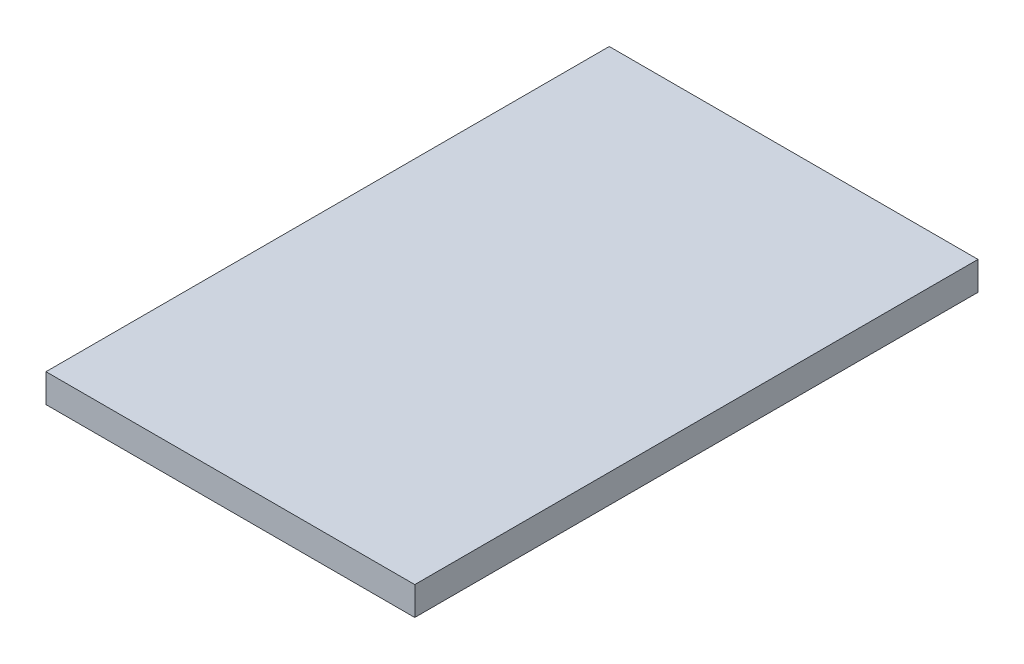
ISO-10303-21;
HEADER;
FILE_DESCRIPTION(('STEP AP214'),'2;1');
FILE_NAME('part.step','',(''),(''),'','','');
FILE_SCHEMA(('AUTOMOTIVE_DESIGN { 1 0 10303 214 1 1 1 1 }'));
ENDSEC;
DATA;
#1=APPLICATION_CONTEXT('core data for automotive mechanical design processes');
#2=APPLICATION_PROTOCOL_DEFINITION('international standard','automotive_design',2000,#1);
#3=PRODUCT_CONTEXT('',#1,'mechanical');
#4=PRODUCT('Part','Part','',(#3));
#5=PRODUCT_RELATED_PRODUCT_CATEGORY('part','',(#4));
#6=PRODUCT_DEFINITION_FORMATION('','',#4);
#7=PRODUCT_DEFINITION_CONTEXT('part definition',#1,'design');
#8=PRODUCT_DEFINITION('design','',#6,#7);
#9=PRODUCT_DEFINITION_SHAPE('','',#8);
#10=(LENGTH_UNIT() NAMED_UNIT(*) SI_UNIT(.MILLI.,.METRE.));
#11=(NAMED_UNIT(*) PLANE_ANGLE_UNIT() SI_UNIT($,.RADIAN.));
#12=(NAMED_UNIT(*) SI_UNIT($,.STERADIAN.) SOLID_ANGLE_UNIT());
#13=UNCERTAINTY_MEASURE_WITH_UNIT(LENGTH_MEASURE(1.E-05),#10,'distance_accuracy_value','');
#14=(GEOMETRIC_REPRESENTATION_CONTEXT(3) GLOBAL_UNCERTAINTY_ASSIGNED_CONTEXT((#13)) GLOBAL_UNIT_ASSIGNED_CONTEXT((#10,
#11,#12)) REPRESENTATION_CONTEXT('',''));
#15=CARTESIAN_POINT('',(0.,0.,0.));
#16=DIRECTION('',(0.,0.,1.));
#17=DIRECTION('',(1.,0.,0.));
#18=AXIS2_PLACEMENT_3D('',#15,#16,#17);
#19=CARTESIAN_POINT('',(0.,4.00000000000402,-21.275));
#20=DIRECTION('',(0.,-1.,0.));
#21=DIRECTION('',(0.,0.,-1.));
#22=AXIS2_PLACEMENT_3D('',#19,#20,#21);
#23=PLANE('',#22);
#24=DIRECTION('',(0.,0.,-1.));
#25=VECTOR('',#24,1.);
#26=CARTESIAN_POINT('',(-6.46507923050827,4.00000000000402,-15.8375));
#27=LINE('',#26,#25);
#28=CARTESIAN_POINT('',(-6.46507923050827,4.00000000000402,-11.4));
#29=VERTEX_POINT('',#28);
#30=CARTESIAN_POINT('',(-6.46507923050827,4.00000000000402,-31.15));
#31=VERTEX_POINT('',#30);
#32=EDGE_CURVE('E28',#29,#31,#27,.T.);
#33=ORIENTED_EDGE('',*,*,#32,.T.);
#34=DIRECTION('',(1.,0.,0.));
#35=VECTOR('',#34,1.);
#36=CARTESIAN_POINT('',(-15.,4.00000000000402,-31.15));
#37=LINE('',#36,#35);
#38=CARTESIAN_POINT('',(6.46507923050827,4.00000000000402,-31.15));
#39=VERTEX_POINT('',#38);
#40=EDGE_CURVE('E89',#31,#39,#37,.T.);
#41=ORIENTED_EDGE('',*,*,#40,.T.);
#42=DIRECTION('',(0.,0.,1.));
#43=VECTOR('',#42,1.);
#44=CARTESIAN_POINT('',(6.46507923050827,4.00000000000402,-15.8375));
#45=LINE('',#44,#43);
#46=CARTESIAN_POINT('',(6.46507923050827,4.00000000000402,-11.4));
#47=VERTEX_POINT('',#46);
#48=EDGE_CURVE('E83',#39,#47,#45,.T.);
#49=ORIENTED_EDGE('',*,*,#48,.T.);
#50=DIRECTION('',(-1.,0.,0.));
#51=VECTOR('',#50,1.);
#52=CARTESIAN_POINT('',(15.,4.00000000000402,-11.4));
#53=LINE('',#52,#51);
#54=EDGE_CURVE('E68',#47,#29,#53,.T.);
#55=ORIENTED_EDGE('',*,*,#54,.T.);
#56=EDGE_LOOP('',(#33,#41,#49,#55));
#57=FACE_BOUND('',#56,.T.);
#58=ADVANCED_FACE('F17',(#57),#23,.T.);
#59=CARTESIAN_POINT('',(0.,5.00000000000402,-21.275));
#60=DIRECTION('',(0.,1.,0.));
#61=DIRECTION('',(1.,0.,0.));
#62=AXIS2_PLACEMENT_3D('',#59,#60,#61);
#63=PLANE('',#62);
#64=DIRECTION('',(0.,0.,1.));
#65=VECTOR('',#64,1.);
#66=CARTESIAN_POINT('',(-6.46507923050827,5.00000000000402,-15.8375));
#67=LINE('',#66,#65);
#68=CARTESIAN_POINT('',(-6.46507923050827,5.00000000000402,-31.15));
#69=VERTEX_POINT('',#68);
#70=CARTESIAN_POINT('',(-6.46507923050827,5.00000000000402,-11.4));
#71=VERTEX_POINT('',#70);
#72=EDGE_CURVE('E11',#69,#71,#67,.T.);
#73=ORIENTED_EDGE('',*,*,#72,.T.);
#74=DIRECTION('',(1.,0.,0.));
#75=VECTOR('',#74,1.);
#76=CARTESIAN_POINT('',(15.,5.00000000000402,-11.4));
#77=LINE('',#76,#75);
#78=CARTESIAN_POINT('',(6.46507923050827,5.00000000000402,-11.4));
#79=VERTEX_POINT('',#78);
#80=EDGE_CURVE('E79',#71,#79,#77,.T.);
#81=ORIENTED_EDGE('',*,*,#80,.T.);
#82=DIRECTION('',(0.,0.,-1.));
#83=VECTOR('',#82,1.);
#84=CARTESIAN_POINT('',(6.46507923050827,5.00000000000402,-15.8375));
#85=LINE('',#84,#83);
#86=CARTESIAN_POINT('',(6.46507923050827,5.00000000000402,-31.15));
#87=VERTEX_POINT('',#86);
#88=EDGE_CURVE('E21',#79,#87,#85,.T.);
#89=ORIENTED_EDGE('',*,*,#88,.T.);
#90=DIRECTION('',(-1.,0.,0.));
#91=VECTOR('',#90,1.);
#92=CARTESIAN_POINT('',(-15.,5.00000000000402,-31.15));
#93=LINE('',#92,#91);
#94=EDGE_CURVE('E96',#87,#69,#93,.T.);
#95=ORIENTED_EDGE('',*,*,#94,.T.);
#96=EDGE_LOOP('',(#73,#81,#89,#95));
#97=FACE_BOUND('',#96,.T.);
#98=ADVANCED_FACE('F165',(#97),#63,.T.);
#99=CARTESIAN_POINT('',(-6.46507923050827,4.00000000000402,-31.15));
#100=DIRECTION('',(-1.,0.,0.));
#101=DIRECTION('',(0.,0.,1.));
#102=AXIS2_PLACEMENT_3D('',#99,#100,#101);
#103=PLANE('',#102);
#104=ORIENTED_EDGE('',*,*,#32,.F.);
#105=DIRECTION('',(0.,1.,0.));
#106=VECTOR('',#105,1.);
#107=CARTESIAN_POINT('',(-6.46507923050827,4.00000000000402,-11.4));
#108=LINE('',#107,#106);
#109=EDGE_CURVE('E74',#29,#71,#108,.T.);
#110=ORIENTED_EDGE('',*,*,#109,.T.);
#111=ORIENTED_EDGE('',*,*,#72,.F.);
#112=DIRECTION('',(0.,1.,0.));
#113=VECTOR('',#112,1.);
#114=CARTESIAN_POINT('',(-6.46507923050827,4.00000000000402,-31.15));
#115=LINE('',#114,#113);
#116=EDGE_CURVE('E101',#31,#69,#115,.T.);
#117=ORIENTED_EDGE('',*,*,#116,.F.);
#118=EDGE_LOOP('',(#104,#110,#111,#117));
#119=FACE_BOUND('',#118,.T.);
#120=ADVANCED_FACE('F156',(#119),#103,.T.);
#121=CARTESIAN_POINT('',(-6.46507923050827,4.00000000000402,-11.4));
#122=DIRECTION('',(0.,0.,1.));
#123=DIRECTION('',(1.,0.,0.));
#124=AXIS2_PLACEMENT_3D('',#121,#122,#123);
#125=PLANE('',#124);
#126=ORIENTED_EDGE('',*,*,#54,.F.);
#127=DIRECTION('',(0.,1.,0.));
#128=VECTOR('',#127,1.);
#129=CARTESIAN_POINT('',(6.46507923050827,4.00000000000402,-11.4));
#130=LINE('',#129,#128);
#131=EDGE_CURVE('E72',#47,#79,#130,.T.);
#132=ORIENTED_EDGE('',*,*,#131,.T.);
#133=ORIENTED_EDGE('',*,*,#80,.F.);
#134=ORIENTED_EDGE('',*,*,#109,.F.);
#135=EDGE_LOOP('',(#126,#132,#133,#134));
#136=FACE_BOUND('',#135,.T.);
#137=ADVANCED_FACE('F70',(#136),#125,.T.);
#138=CARTESIAN_POINT('',(6.46507923050827,4.00000000000402,-11.4));
#139=DIRECTION('',(1.,0.,0.));
#140=DIRECTION('',(0.,1.,0.));
#141=AXIS2_PLACEMENT_3D('',#138,#139,#140);
#142=PLANE('',#141);
#143=ORIENTED_EDGE('',*,*,#48,.F.);
#144=DIRECTION('',(0.,1.,0.));
#145=VECTOR('',#144,1.);
#146=CARTESIAN_POINT('',(6.46507923050827,4.00000000000402,-31.15));
#147=LINE('',#146,#145);
#148=EDGE_CURVE('E91',#39,#87,#147,.T.);
#149=ORIENTED_EDGE('',*,*,#148,.T.);
#150=ORIENTED_EDGE('',*,*,#88,.F.);
#151=ORIENTED_EDGE('',*,*,#131,.F.);
#152=EDGE_LOOP('',(#143,#149,#150,#151));
#153=FACE_BOUND('',#152,.T.);
#154=ADVANCED_FACE('F19',(#153),#142,.T.);
#155=CARTESIAN_POINT('',(6.46507923050827,4.00000000000402,-31.15));
#156=DIRECTION('',(0.,0.,-1.));
#157=DIRECTION('',(0.,-1.,0.));
#158=AXIS2_PLACEMENT_3D('',#155,#156,#157);
#159=PLANE('',#158);
#160=ORIENTED_EDGE('',*,*,#40,.F.);
#161=ORIENTED_EDGE('',*,*,#116,.T.);
#162=ORIENTED_EDGE('',*,*,#94,.F.);
#163=ORIENTED_EDGE('',*,*,#148,.F.);
#164=EDGE_LOOP('',(#160,#161,#162,#163));
#165=FACE_BOUND('',#164,.T.);
#166=ADVANCED_FACE('F171',(#165),#159,.T.);
#167=CLOSED_SHELL('',(#58,#98,#120,#137,#154,#166));
#168=MANIFOLD_SOLID_BREP('B1',#167);
#169=ADVANCED_BREP_SHAPE_REPRESENTATION('',(#18,#168),#14);
#170=SHAPE_DEFINITION_REPRESENTATION(#9,#169);
ENDSEC;
END-ISO-10303-21;
